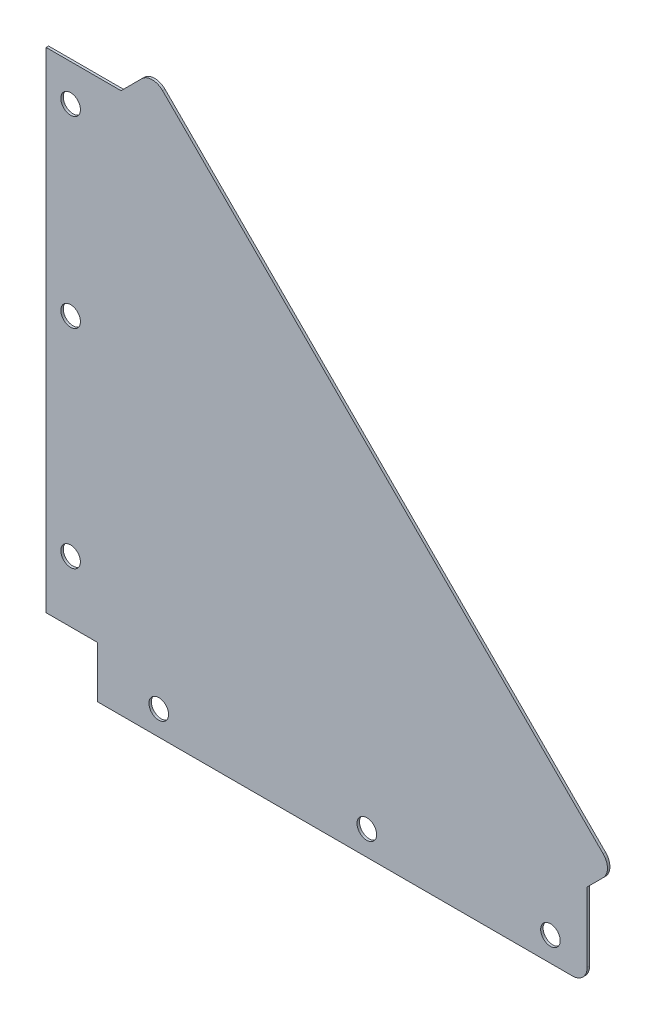
ISO-10303-21;
HEADER;
FILE_DESCRIPTION(('STEP AP214'),'2;1');
FILE_NAME('part.step','',(''),(''),'','','');
FILE_SCHEMA(('AUTOMOTIVE_DESIGN { 1 0 10303 214 1 1 1 1 }'));
ENDSEC;
DATA;
#1=APPLICATION_CONTEXT('core data for automotive mechanical design processes');
#2=APPLICATION_PROTOCOL_DEFINITION('international standard','automotive_design',2000,#1);
#3=PRODUCT_CONTEXT('',#1,'mechanical');
#4=PRODUCT('Part','Part','',(#3));
#5=PRODUCT_RELATED_PRODUCT_CATEGORY('part','',(#4));
#6=PRODUCT_DEFINITION_FORMATION('','',#4);
#7=PRODUCT_DEFINITION_CONTEXT('part definition',#1,'design');
#8=PRODUCT_DEFINITION('design','',#6,#7);
#9=PRODUCT_DEFINITION_SHAPE('','',#8);
#10=(LENGTH_UNIT() NAMED_UNIT(*) SI_UNIT(.MILLI.,.METRE.));
#11=(NAMED_UNIT(*) PLANE_ANGLE_UNIT() SI_UNIT($,.RADIAN.));
#12=(NAMED_UNIT(*) SI_UNIT($,.STERADIAN.) SOLID_ANGLE_UNIT());
#13=UNCERTAINTY_MEASURE_WITH_UNIT(LENGTH_MEASURE(1.E-05),#10,'distance_accuracy_value','');
#14=(GEOMETRIC_REPRESENTATION_CONTEXT(3) GLOBAL_UNCERTAINTY_ASSIGNED_CONTEXT((#13)) GLOBAL_UNIT_ASSIGNED_CONTEXT((#10,
#11,#12)) REPRESENTATION_CONTEXT('',''));
#15=CARTESIAN_POINT('',(0.,0.,0.));
#16=DIRECTION('',(0.,0.,1.));
#17=DIRECTION('',(1.,0.,0.));
#18=AXIS2_PLACEMENT_3D('',#15,#16,#17);
#19=CARTESIAN_POINT('',(215.,6.,1.));
#20=DIRECTION('',(0.,0.,1.));
#21=DIRECTION('',(1.,0.,0.));
#22=AXIS2_PLACEMENT_3D('',#19,#20,#21);
#23=PLANE('',#22);
#24=CARTESIAN_POINT('',(131.,10.,1.));
#25=DIRECTION('',(0.,0.,1.));
#26=DIRECTION('',(1.,0.,0.));
#27=AXIS2_PLACEMENT_3D('',#24,#25,#26);
#28=CIRCLE('',#27,3.99999999999999);
#29=CARTESIAN_POINT('',(135.,10.,1.));
#30=VERTEX_POINT('',#29);
#31=EDGE_CURVE('E299',#30,#30,#28,.T.);
#32=ORIENTED_EDGE('',*,*,#31,.F.);
#33=EDGE_LOOP('',(#32));
#34=FACE_BOUND('',#33,.T.);
#35=CARTESIAN_POINT('',(10.,131.,1.));
#36=DIRECTION('',(0.,0.,1.));
#37=DIRECTION('',(1.,0.,0.));
#38=AXIS2_PLACEMENT_3D('',#35,#36,#37);
#39=CIRCLE('',#38,4.);
#40=CARTESIAN_POINT('',(14.,131.,1.));
#41=VERTEX_POINT('',#40);
#42=EDGE_CURVE('E311',#41,#41,#39,.T.);
#43=ORIENTED_EDGE('',*,*,#42,.F.);
#44=EDGE_LOOP('',(#43));
#45=FACE_BOUND('',#44,.T.);
#46=CARTESIAN_POINT('',(10.,206.,1.));
#47=DIRECTION('',(0.,0.,1.));
#48=DIRECTION('',(1.,0.,0.));
#49=AXIS2_PLACEMENT_3D('',#46,#47,#48);
#50=CIRCLE('',#49,4.);
#51=CARTESIAN_POINT('',(14.,206.,1.));
#52=VERTEX_POINT('',#51);
#53=EDGE_CURVE('E158',#52,#52,#50,.T.);
#54=ORIENTED_EDGE('',*,*,#53,.F.);
#55=EDGE_LOOP('',(#54));
#56=FACE_BOUND('',#55,.T.);
#57=DIRECTION('',(0.,-1.,0.));
#58=VECTOR('',#57,1.);
#59=CARTESIAN_POINT('',(0.,221.,1.));
#60=LINE('',#59,#58);
#61=CARTESIAN_POINT('',(0.,221.,1.));
#62=VERTEX_POINT('',#61);
#63=CARTESIAN_POINT('',(0.,21.,1.));
#64=VERTEX_POINT('',#63);
#65=EDGE_CURVE('E177',#62,#64,#60,.T.);
#66=ORIENTED_EDGE('',*,*,#65,.T.);
#67=DIRECTION('',(1.,0.,0.));
#68=VECTOR('',#67,1.);
#69=CARTESIAN_POINT('',(0.,21.,1.));
#70=LINE('',#69,#68);
#71=CARTESIAN_POINT('',(21.,21.,1.));
#72=VERTEX_POINT('',#71);
#73=EDGE_CURVE('E105',#64,#72,#70,.T.);
#74=ORIENTED_EDGE('',*,*,#73,.T.);
#75=DIRECTION('',(0.,-1.,0.));
#76=VECTOR('',#75,1.);
#77=CARTESIAN_POINT('',(21.,21.,1.));
#78=LINE('',#77,#76);
#79=CARTESIAN_POINT('',(21.,0.,1.));
#80=VERTEX_POINT('',#79);
#81=EDGE_CURVE('E204',#72,#80,#78,.T.);
#82=ORIENTED_EDGE('',*,*,#81,.T.);
#83=DIRECTION('',(1.,0.,0.));
#84=VECTOR('',#83,1.);
#85=CARTESIAN_POINT('',(21.,0.,1.));
#86=LINE('',#85,#84);
#87=CARTESIAN_POINT('',(215.,0.,1.));
#88=VERTEX_POINT('',#87);
#89=EDGE_CURVE('E223',#80,#88,#86,.T.);
#90=ORIENTED_EDGE('',*,*,#89,.T.);
#91=CARTESIAN_POINT('',(215.,6.,1.));
#92=DIRECTION('',(0.,0.,1.));
#93=DIRECTION('',(1.,0.,0.));
#94=AXIS2_PLACEMENT_3D('',#91,#92,#93);
#95=CIRCLE('',#94,6.);
#96=CARTESIAN_POINT('',(221.,6.00000000000004,1.));
#97=VERTEX_POINT('',#96);
#98=EDGE_CURVE('E220',#88,#97,#95,.T.);
#99=ORIENTED_EDGE('',*,*,#98,.T.);
#100=DIRECTION('',(0.,1.,0.));
#101=VECTOR('',#100,1.);
#102=CARTESIAN_POINT('',(221.,6.00000000000004,1.));
#103=LINE('',#102,#101);
#104=CARTESIAN_POINT('',(221.,34.5,1.));
#105=VERTEX_POINT('',#104);
#106=EDGE_CURVE('E222',#97,#105,#103,.T.);
#107=ORIENTED_EDGE('',*,*,#106,.T.);
#108=DIRECTION('',(0.707106781186548,0.707106781186547,0.));
#109=VECTOR('',#108,1.);
#110=CARTESIAN_POINT('',(221.,34.5,1.));
#111=LINE('',#110,#109);
#112=CARTESIAN_POINT('',(227.535533905933,41.0355339059331,1.));
#113=VERTEX_POINT('',#112);
#114=EDGE_CURVE('E225',#105,#113,#111,.T.);
#115=ORIENTED_EDGE('',*,*,#114,.T.);
#116=CARTESIAN_POINT('',(223.292893218813,45.278174593052,1.));
#117=DIRECTION('',(0.,0.,1.));
#118=DIRECTION('',(1.,0.,0.));
#119=AXIS2_PLACEMENT_3D('',#116,#117,#118);
#120=CIRCLE('',#119,6.00000000000032);
#121=CARTESIAN_POINT('',(227.535533905933,49.5208152801715,1.));
#122=VERTEX_POINT('',#121);
#123=EDGE_CURVE('E231',#113,#122,#120,.T.);
#124=ORIENTED_EDGE('',*,*,#123,.T.);
#125=DIRECTION('',(-0.707106781186549,0.707106781186546,0.));
#126=VECTOR('',#125,1.);
#127=CARTESIAN_POINT('',(227.535533905933,49.5208152801717,1.));
#128=LINE('',#127,#126);
#129=CARTESIAN_POINT('',(47.5710678118651,229.485281374239,1.));
#130=VERTEX_POINT('',#129);
#131=EDGE_CURVE('E136',#122,#130,#128,.T.);
#132=ORIENTED_EDGE('',*,*,#131,.T.);
#133=CARTESIAN_POINT('',(43.3284271247454,225.242640687119,1.));
#134=DIRECTION('',(0.,0.,1.));
#135=DIRECTION('',(1.,0.,0.));
#136=AXIS2_PLACEMENT_3D('',#133,#134,#135);
#137=CIRCLE('',#136,6.00000000000027);
#138=CARTESIAN_POINT('',(39.0857864376263,229.485281374239,1.));
#139=VERTEX_POINT('',#138);
#140=EDGE_CURVE('E130',#130,#139,#137,.T.);
#141=ORIENTED_EDGE('',*,*,#140,.T.);
#142=DIRECTION('',(-0.707106781186545,-0.70710678118655,0.));
#143=VECTOR('',#142,1.);
#144=CARTESIAN_POINT('',(39.0857864376265,229.485281374239,1.));
#145=LINE('',#144,#143);
#146=CARTESIAN_POINT('',(30.6005050633876,221.,1.));
#147=VERTEX_POINT('',#146);
#148=EDGE_CURVE('E134',#139,#147,#145,.T.);
#149=ORIENTED_EDGE('',*,*,#148,.T.);
#150=DIRECTION('',(-1.,0.,0.));
#151=VECTOR('',#150,1.);
#152=CARTESIAN_POINT('',(30.6005050633876,221.,1.));
#153=LINE('',#152,#151);
#154=EDGE_CURVE('E50',#147,#62,#153,.T.);
#155=ORIENTED_EDGE('',*,*,#154,.T.);
#156=EDGE_LOOP('',(#66,#74,#82,#90,#99,#107,#115,#124,#132,#141,#149,#155));
#157=FACE_BOUND('',#156,.T.);
#158=CARTESIAN_POINT('',(10.,46.0000000000003,1.));
#159=DIRECTION('',(0.,0.,1.));
#160=DIRECTION('',(1.,0.,0.));
#161=AXIS2_PLACEMENT_3D('',#158,#159,#160);
#162=CIRCLE('',#161,4.);
#163=CARTESIAN_POINT('',(14.,46.0000000000003,1.));
#164=VERTEX_POINT('',#163);
#165=EDGE_CURVE('E317',#164,#164,#162,.T.);
#166=ORIENTED_EDGE('',*,*,#165,.F.);
#167=EDGE_LOOP('',(#166));
#168=FACE_BOUND('',#167,.T.);
#169=CARTESIAN_POINT('',(46.,10.,1.));
#170=DIRECTION('',(0.,0.,1.));
#171=DIRECTION('',(1.,0.,0.));
#172=AXIS2_PLACEMENT_3D('',#169,#170,#171);
#173=CIRCLE('',#172,4.00000000000001);
#174=CARTESIAN_POINT('',(50.,10.,1.));
#175=VERTEX_POINT('',#174);
#176=EDGE_CURVE('E305',#175,#175,#173,.T.);
#177=ORIENTED_EDGE('',*,*,#176,.F.);
#178=EDGE_LOOP('',(#177));
#179=FACE_BOUND('',#178,.T.);
#180=CARTESIAN_POINT('',(206.,10.,1.));
#181=DIRECTION('',(0.,0.,1.));
#182=DIRECTION('',(1.,0.,0.));
#183=AXIS2_PLACEMENT_3D('',#180,#181,#182);
#184=CIRCLE('',#183,3.99999999999999);
#185=CARTESIAN_POINT('',(210.,10.,1.));
#186=VERTEX_POINT('',#185);
#187=EDGE_CURVE('E290',#186,#186,#184,.T.);
#188=ORIENTED_EDGE('',*,*,#187,.F.);
#189=EDGE_LOOP('',(#188));
#190=FACE_BOUND('',#189,.T.);
#191=ADVANCED_FACE('F33',(#34,#45,#56,#157,#168,#179,#190),#23,.T.);
#192=CARTESIAN_POINT('',(215.,6.,0.));
#193=DIRECTION('',(0.,0.,1.));
#194=DIRECTION('',(1.,0.,0.));
#195=AXIS2_PLACEMENT_3D('',#192,#193,#194);
#196=PLANE('',#195);
#197=DIRECTION('',(0.,-1.,0.));
#198=VECTOR('',#197,1.);
#199=CARTESIAN_POINT('',(0.,221.,0.));
#200=LINE('',#199,#198);
#201=CARTESIAN_POINT('',(0.,221.,0.));
#202=VERTEX_POINT('',#201);
#203=CARTESIAN_POINT('',(0.,21.,0.));
#204=VERTEX_POINT('',#203);
#205=EDGE_CURVE('E154',#202,#204,#200,.T.);
#206=ORIENTED_EDGE('',*,*,#205,.F.);
#207=DIRECTION('',(-1.,0.,0.));
#208=VECTOR('',#207,1.);
#209=CARTESIAN_POINT('',(30.6005050633876,221.,0.));
#210=LINE('',#209,#208);
#211=CARTESIAN_POINT('',(30.6005050633876,221.,0.));
#212=VERTEX_POINT('',#211);
#213=EDGE_CURVE('E97',#212,#202,#210,.T.);
#214=ORIENTED_EDGE('',*,*,#213,.F.);
#215=DIRECTION('',(-0.707106781186545,-0.70710678118655,0.));
#216=VECTOR('',#215,1.);
#217=CARTESIAN_POINT('',(39.0857864376265,229.485281374239,0.));
#218=LINE('',#217,#216);
#219=CARTESIAN_POINT('',(39.0857864376263,229.485281374239,0.));
#220=VERTEX_POINT('',#219);
#221=EDGE_CURVE('E91',#220,#212,#218,.T.);
#222=ORIENTED_EDGE('',*,*,#221,.F.);
#223=CARTESIAN_POINT('',(43.3284271247454,225.242640687119,0.));
#224=DIRECTION('',(0.,0.,1.));
#225=DIRECTION('',(1.,0.,0.));
#226=AXIS2_PLACEMENT_3D('',#223,#224,#225);
#227=CIRCLE('',#226,6.00000000000027);
#228=CARTESIAN_POINT('',(47.5710678118651,229.485281374239,0.));
#229=VERTEX_POINT('',#228);
#230=EDGE_CURVE('E144',#229,#220,#227,.T.);
#231=ORIENTED_EDGE('',*,*,#230,.F.);
#232=DIRECTION('',(-0.707106781186549,0.707106781186546,0.));
#233=VECTOR('',#232,1.);
#234=CARTESIAN_POINT('',(227.535533905933,49.5208152801717,0.));
#235=LINE('',#234,#233);
#236=CARTESIAN_POINT('',(227.535533905933,49.5208152801715,0.));
#237=VERTEX_POINT('',#236);
#238=EDGE_CURVE('E172',#237,#229,#235,.T.);
#239=ORIENTED_EDGE('',*,*,#238,.F.);
#240=CARTESIAN_POINT('',(223.292893218813,45.278174593052,0.));
#241=DIRECTION('',(0.,0.,1.));
#242=DIRECTION('',(1.,0.,0.));
#243=AXIS2_PLACEMENT_3D('',#240,#241,#242);
#244=CIRCLE('',#243,6.00000000000032);
#245=CARTESIAN_POINT('',(227.535533905933,41.0355339059331,0.));
#246=VERTEX_POINT('',#245);
#247=EDGE_CURVE('E170',#246,#237,#244,.T.);
#248=ORIENTED_EDGE('',*,*,#247,.F.);
#249=DIRECTION('',(0.707106781186548,0.707106781186547,0.));
#250=VECTOR('',#249,1.);
#251=CARTESIAN_POINT('',(221.,34.5,0.));
#252=LINE('',#251,#250);
#253=CARTESIAN_POINT('',(221.,34.5,0.));
#254=VERTEX_POINT('',#253);
#255=EDGE_CURVE('E168',#254,#246,#252,.T.);
#256=ORIENTED_EDGE('',*,*,#255,.F.);
#257=DIRECTION('',(0.,1.,0.));
#258=VECTOR('',#257,1.);
#259=CARTESIAN_POINT('',(221.,6.00000000000004,0.));
#260=LINE('',#259,#258);
#261=CARTESIAN_POINT('',(221.,6.00000000000004,0.));
#262=VERTEX_POINT('',#261);
#263=EDGE_CURVE('E166',#262,#254,#260,.T.);
#264=ORIENTED_EDGE('',*,*,#263,.F.);
#265=CARTESIAN_POINT('',(215.,6.,0.));
#266=DIRECTION('',(0.,0.,1.));
#267=DIRECTION('',(1.,0.,0.));
#268=AXIS2_PLACEMENT_3D('',#265,#266,#267);
#269=CIRCLE('',#268,6.);
#270=CARTESIAN_POINT('',(215.,0.,0.));
#271=VERTEX_POINT('',#270);
#272=EDGE_CURVE('E164',#271,#262,#269,.T.);
#273=ORIENTED_EDGE('',*,*,#272,.F.);
#274=DIRECTION('',(1.,0.,0.));
#275=VECTOR('',#274,1.);
#276=CARTESIAN_POINT('',(21.,0.,0.));
#277=LINE('',#276,#275);
#278=CARTESIAN_POINT('',(21.,0.,0.));
#279=VERTEX_POINT('',#278);
#280=EDGE_CURVE('E162',#279,#271,#277,.T.);
#281=ORIENTED_EDGE('',*,*,#280,.F.);
#282=DIRECTION('',(0.,-1.,0.));
#283=VECTOR('',#282,1.);
#284=CARTESIAN_POINT('',(21.,21.,0.));
#285=LINE('',#284,#283);
#286=CARTESIAN_POINT('',(21.,21.,0.));
#287=VERTEX_POINT('',#286);
#288=EDGE_CURVE('E160',#287,#279,#285,.T.);
#289=ORIENTED_EDGE('',*,*,#288,.F.);
#290=DIRECTION('',(1.,0.,0.));
#291=VECTOR('',#290,1.);
#292=CARTESIAN_POINT('',(0.,21.,0.));
#293=LINE('',#292,#291);
#294=EDGE_CURVE('E157',#204,#287,#293,.T.);
#295=ORIENTED_EDGE('',*,*,#294,.F.);
#296=EDGE_LOOP('',(#206,#214,#222,#231,#239,#248,#256,#264,#273,#281,#289,#295));
#297=FACE_BOUND('',#296,.T.);
#298=CARTESIAN_POINT('',(10.,206.,0.));
#299=DIRECTION('',(0.,0.,1.));
#300=DIRECTION('',(1.,0.,0.));
#301=AXIS2_PLACEMENT_3D('',#298,#299,#300);
#302=CIRCLE('',#301,4.);
#303=CARTESIAN_POINT('',(14.,206.,0.));
#304=VERTEX_POINT('',#303);
#305=EDGE_CURVE('E320',#304,#304,#302,.T.);
#306=ORIENTED_EDGE('',*,*,#305,.T.);
#307=EDGE_LOOP('',(#306));
#308=FACE_BOUND('',#307,.T.);
#309=CARTESIAN_POINT('',(10.,46.0000000000003,0.));
#310=DIRECTION('',(0.,0.,1.));
#311=DIRECTION('',(1.,0.,0.));
#312=AXIS2_PLACEMENT_3D('',#309,#310,#311);
#313=CIRCLE('',#312,4.);
#314=CARTESIAN_POINT('',(14.,46.0000000000003,0.));
#315=VERTEX_POINT('',#314);
#316=EDGE_CURVE('E314',#315,#315,#313,.T.);
#317=ORIENTED_EDGE('',*,*,#316,.T.);
#318=EDGE_LOOP('',(#317));
#319=FACE_BOUND('',#318,.T.);
#320=CARTESIAN_POINT('',(10.,131.,0.));
#321=DIRECTION('',(0.,0.,1.));
#322=DIRECTION('',(1.,0.,0.));
#323=AXIS2_PLACEMENT_3D('',#320,#321,#322);
#324=CIRCLE('',#323,4.);
#325=CARTESIAN_POINT('',(14.,131.,0.));
#326=VERTEX_POINT('',#325);
#327=EDGE_CURVE('E308',#326,#326,#324,.T.);
#328=ORIENTED_EDGE('',*,*,#327,.T.);
#329=EDGE_LOOP('',(#328));
#330=FACE_BOUND('',#329,.T.);
#331=CARTESIAN_POINT('',(46.,10.,0.));
#332=DIRECTION('',(0.,0.,1.));
#333=DIRECTION('',(1.,0.,0.));
#334=AXIS2_PLACEMENT_3D('',#331,#332,#333);
#335=CIRCLE('',#334,4.00000000000001);
#336=CARTESIAN_POINT('',(50.,10.,0.));
#337=VERTEX_POINT('',#336);
#338=EDGE_CURVE('E302',#337,#337,#335,.T.);
#339=ORIENTED_EDGE('',*,*,#338,.T.);
#340=EDGE_LOOP('',(#339));
#341=FACE_BOUND('',#340,.T.);
#342=CARTESIAN_POINT('',(131.,10.,0.));
#343=DIRECTION('',(0.,0.,1.));
#344=DIRECTION('',(1.,0.,0.));
#345=AXIS2_PLACEMENT_3D('',#342,#343,#344);
#346=CIRCLE('',#345,3.99999999999999);
#347=CARTESIAN_POINT('',(135.,10.,0.));
#348=VERTEX_POINT('',#347);
#349=EDGE_CURVE('E296',#348,#348,#346,.T.);
#350=ORIENTED_EDGE('',*,*,#349,.T.);
#351=EDGE_LOOP('',(#350));
#352=FACE_BOUND('',#351,.T.);
#353=CARTESIAN_POINT('',(206.,10.,0.));
#354=DIRECTION('',(0.,0.,1.));
#355=DIRECTION('',(1.,0.,0.));
#356=AXIS2_PLACEMENT_3D('',#353,#354,#355);
#357=CIRCLE('',#356,3.99999999999999);
#358=CARTESIAN_POINT('',(210.,10.,0.));
#359=VERTEX_POINT('',#358);
#360=EDGE_CURVE('E293',#359,#359,#357,.T.);
#361=ORIENTED_EDGE('',*,*,#360,.T.);
#362=EDGE_LOOP('',(#361));
#363=FACE_BOUND('',#362,.T.);
#364=ADVANCED_FACE('F208',(#297,#308,#319,#330,#341,#352,#363),#196,.F.);
#365=CARTESIAN_POINT('',(0.,221.,1.));
#366=DIRECTION('',(1.,0.,0.));
#367=DIRECTION('',(0.,1.,0.));
#368=AXIS2_PLACEMENT_3D('',#365,#366,#367);
#369=PLANE('',#368);
#370=ORIENTED_EDGE('',*,*,#205,.T.);
#371=DIRECTION('',(0.,0.,-1.));
#372=VECTOR('',#371,1.);
#373=CARTESIAN_POINT('',(0.,21.,1.));
#374=LINE('',#373,#372);
#375=EDGE_CURVE('E11',#64,#204,#374,.T.);
#376=ORIENTED_EDGE('',*,*,#375,.F.);
#377=ORIENTED_EDGE('',*,*,#65,.F.);
#378=DIRECTION('',(0.,0.,-1.));
#379=VECTOR('',#378,1.);
#380=CARTESIAN_POINT('',(0.,221.,1.));
#381=LINE('',#380,#379);
#382=EDGE_CURVE('E150',#62,#202,#381,.T.);
#383=ORIENTED_EDGE('',*,*,#382,.T.);
#384=EDGE_LOOP('',(#370,#376,#377,#383));
#385=FACE_BOUND('',#384,.T.);
#386=ADVANCED_FACE('F35',(#385),#369,.F.);
#387=CARTESIAN_POINT('',(0.,21.,1.));
#388=DIRECTION('',(0.,1.,0.));
#389=DIRECTION('',(0.,0.,1.));
#390=AXIS2_PLACEMENT_3D('',#387,#388,#389);
#391=PLANE('',#390);
#392=ORIENTED_EDGE('',*,*,#294,.T.);
#393=DIRECTION('',(0.,0.,-1.));
#394=VECTOR('',#393,1.);
#395=CARTESIAN_POINT('',(21.,21.,1.));
#396=LINE('',#395,#394);
#397=EDGE_CURVE('E42',#72,#287,#396,.T.);
#398=ORIENTED_EDGE('',*,*,#397,.F.);
#399=ORIENTED_EDGE('',*,*,#73,.F.);
#400=ORIENTED_EDGE('',*,*,#375,.T.);
#401=EDGE_LOOP('',(#392,#398,#399,#400));
#402=FACE_BOUND('',#401,.T.);
#403=ADVANCED_FACE('F448',(#402),#391,.F.);
#404=CARTESIAN_POINT('',(21.,21.,1.));
#405=DIRECTION('',(1.,0.,0.));
#406=DIRECTION('',(0.,1.,0.));
#407=AXIS2_PLACEMENT_3D('',#404,#405,#406);
#408=PLANE('',#407);
#409=ORIENTED_EDGE('',*,*,#288,.T.);
#410=DIRECTION('',(0.,0.,-1.));
#411=VECTOR('',#410,1.);
#412=CARTESIAN_POINT('',(21.,0.,1.));
#413=LINE('',#412,#411);
#414=EDGE_CURVE('E196',#80,#279,#413,.T.);
#415=ORIENTED_EDGE('',*,*,#414,.F.);
#416=ORIENTED_EDGE('',*,*,#81,.F.);
#417=ORIENTED_EDGE('',*,*,#397,.T.);
#418=EDGE_LOOP('',(#409,#415,#416,#417));
#419=FACE_BOUND('',#418,.T.);
#420=ADVANCED_FACE('F202',(#419),#408,.F.);
#421=CARTESIAN_POINT('',(21.,0.,1.));
#422=DIRECTION('',(0.,1.,0.));
#423=DIRECTION('',(0.,0.,1.));
#424=AXIS2_PLACEMENT_3D('',#421,#422,#423);
#425=PLANE('',#424);
#426=ORIENTED_EDGE('',*,*,#280,.T.);
#427=DIRECTION('',(0.,0.,-1.));
#428=VECTOR('',#427,1.);
#429=CARTESIAN_POINT('',(215.,0.,1.));
#430=LINE('',#429,#428);
#431=EDGE_CURVE('E193',#88,#271,#430,.T.);
#432=ORIENTED_EDGE('',*,*,#431,.F.);
#433=ORIENTED_EDGE('',*,*,#89,.F.);
#434=ORIENTED_EDGE('',*,*,#414,.T.);
#435=EDGE_LOOP('',(#426,#432,#433,#434));
#436=FACE_BOUND('',#435,.T.);
#437=ADVANCED_FACE('F214',(#436),#425,.F.);
#438=CARTESIAN_POINT('',(215.,6.,1.));
#439=DIRECTION('',(0.,0.,-1.));
#440=DIRECTION('',(-1.,0.,0.));
#441=AXIS2_PLACEMENT_3D('',#438,#439,#440);
#442=CYLINDRICAL_SURFACE('',#441,6.);
#443=ORIENTED_EDGE('',*,*,#272,.T.);
#444=DIRECTION('',(0.,0.,-1.));
#445=VECTOR('',#444,1.);
#446=CARTESIAN_POINT('',(221.,6.00000000000004,1.));
#447=LINE('',#446,#445);
#448=EDGE_CURVE('E190',#97,#262,#447,.T.);
#449=ORIENTED_EDGE('',*,*,#448,.F.);
#450=ORIENTED_EDGE('',*,*,#98,.F.);
#451=ORIENTED_EDGE('',*,*,#431,.T.);
#452=EDGE_LOOP('',(#443,#449,#450,#451));
#453=FACE_BOUND('',#452,.T.);
#454=ADVANCED_FACE('F218',(#453),#442,.T.);
#455=CARTESIAN_POINT('',(221.,6.00000000000004,1.));
#456=DIRECTION('',(-1.,0.,0.));
#457=DIRECTION('',(0.,0.,1.));
#458=AXIS2_PLACEMENT_3D('',#455,#456,#457);
#459=PLANE('',#458);
#460=ORIENTED_EDGE('',*,*,#263,.T.);
#461=DIRECTION('',(0.,0.,-1.));
#462=VECTOR('',#461,1.);
#463=CARTESIAN_POINT('',(221.,34.5,1.));
#464=LINE('',#463,#462);
#465=EDGE_CURVE('E187',#105,#254,#464,.T.);
#466=ORIENTED_EDGE('',*,*,#465,.F.);
#467=ORIENTED_EDGE('',*,*,#106,.F.);
#468=ORIENTED_EDGE('',*,*,#448,.T.);
#469=EDGE_LOOP('',(#460,#466,#467,#468));
#470=FACE_BOUND('',#469,.T.);
#471=ADVANCED_FACE('F413',(#470),#459,.F.);
#472=CARTESIAN_POINT('',(221.,34.5,1.));
#473=DIRECTION('',(-0.707106781186547,0.707106781186548,0.));
#474=DIRECTION('',(-0.707106781186548,-0.707106781186547,0.));
#475=AXIS2_PLACEMENT_3D('',#472,#473,#474);
#476=PLANE('',#475);
#477=ORIENTED_EDGE('',*,*,#255,.T.);
#478=DIRECTION('',(0.,0.,-1.));
#479=VECTOR('',#478,1.);
#480=CARTESIAN_POINT('',(227.535533905933,41.0355339059331,1.));
#481=LINE('',#480,#479);
#482=EDGE_CURVE('E184',#113,#246,#481,.T.);
#483=ORIENTED_EDGE('',*,*,#482,.F.);
#484=ORIENTED_EDGE('',*,*,#114,.F.);
#485=ORIENTED_EDGE('',*,*,#465,.T.);
#486=EDGE_LOOP('',(#477,#483,#484,#485));
#487=FACE_BOUND('',#486,.T.);
#488=ADVANCED_FACE('F404',(#487),#476,.F.);
#489=CARTESIAN_POINT('',(223.292893218813,45.278174593052,1.));
#490=DIRECTION('',(0.,0.,-1.));
#491=DIRECTION('',(-1.,0.,0.));
#492=AXIS2_PLACEMENT_3D('',#489,#490,#491);
#493=CYLINDRICAL_SURFACE('',#492,6.00000000000032);
#494=ORIENTED_EDGE('',*,*,#247,.T.);
#495=DIRECTION('',(0.,0.,-1.));
#496=VECTOR('',#495,1.);
#497=CARTESIAN_POINT('',(227.535533905933,49.5208152801715,1.));
#498=LINE('',#497,#496);
#499=EDGE_CURVE('E181',#122,#237,#498,.T.);
#500=ORIENTED_EDGE('',*,*,#499,.F.);
#501=ORIENTED_EDGE('',*,*,#123,.F.);
#502=ORIENTED_EDGE('',*,*,#482,.T.);
#503=EDGE_LOOP('',(#494,#500,#501,#502));
#504=FACE_BOUND('',#503,.T.);
#505=ADVANCED_FACE('F237',(#504),#493,.T.);
#506=CARTESIAN_POINT('',(227.535533905933,49.5208152801717,1.));
#507=DIRECTION('',(-0.707106781186546,-0.707106781186549,0.));
#508=DIRECTION('',(0.707106781186549,-0.707106781186546,0.));
#509=AXIS2_PLACEMENT_3D('',#506,#507,#508);
#510=PLANE('',#509);
#511=ORIENTED_EDGE('',*,*,#238,.T.);
#512=DIRECTION('',(0.,0.,-1.));
#513=VECTOR('',#512,1.);
#514=CARTESIAN_POINT('',(47.5710678118651,229.485281374239,1.));
#515=LINE('',#514,#513);
#516=EDGE_CURVE('E145',#130,#229,#515,.T.);
#517=ORIENTED_EDGE('',*,*,#516,.F.);
#518=ORIENTED_EDGE('',*,*,#131,.F.);
#519=ORIENTED_EDGE('',*,*,#499,.T.);
#520=EDGE_LOOP('',(#511,#517,#518,#519));
#521=FACE_BOUND('',#520,.T.);
#522=ADVANCED_FACE('F241',(#521),#510,.F.);
#523=CARTESIAN_POINT('',(43.3284271247454,225.242640687119,1.));
#524=DIRECTION('',(0.,0.,-1.));
#525=DIRECTION('',(-1.,0.,0.));
#526=AXIS2_PLACEMENT_3D('',#523,#524,#525);
#527=CYLINDRICAL_SURFACE('',#526,6.00000000000027);
#528=ORIENTED_EDGE('',*,*,#230,.T.);
#529=DIRECTION('',(0.,0.,-1.));
#530=VECTOR('',#529,1.);
#531=CARTESIAN_POINT('',(39.0857864376263,229.485281374239,1.));
#532=LINE('',#531,#530);
#533=EDGE_CURVE('E141',#139,#220,#532,.T.);
#534=ORIENTED_EDGE('',*,*,#533,.F.);
#535=ORIENTED_EDGE('',*,*,#140,.F.);
#536=ORIENTED_EDGE('',*,*,#516,.T.);
#537=EDGE_LOOP('',(#528,#534,#535,#536));
#538=FACE_BOUND('',#537,.T.);
#539=ADVANCED_FACE('F142',(#538),#527,.T.);
#540=CARTESIAN_POINT('',(39.0857864376265,229.485281374239,1.));
#541=DIRECTION('',(0.70710678118655,-0.707106781186545,0.));
#542=DIRECTION('',(0.707106781186545,0.70710678118655,0.));
#543=AXIS2_PLACEMENT_3D('',#540,#541,#542);
#544=PLANE('',#543);
#545=ORIENTED_EDGE('',*,*,#221,.T.);
#546=DIRECTION('',(0.,0.,-1.));
#547=VECTOR('',#546,1.);
#548=CARTESIAN_POINT('',(30.6005050633876,221.,1.));
#549=LINE('',#548,#547);
#550=EDGE_CURVE('E146',#147,#212,#549,.T.);
#551=ORIENTED_EDGE('',*,*,#550,.F.);
#552=ORIENTED_EDGE('',*,*,#148,.F.);
#553=ORIENTED_EDGE('',*,*,#533,.T.);
#554=EDGE_LOOP('',(#545,#551,#552,#553));
#555=FACE_BOUND('',#554,.T.);
#556=ADVANCED_FACE('F148',(#555),#544,.F.);
#557=CARTESIAN_POINT('',(30.6005050633876,221.,1.));
#558=DIRECTION('',(0.,-1.,0.));
#559=DIRECTION('',(0.,0.,-1.));
#560=AXIS2_PLACEMENT_3D('',#557,#558,#559);
#561=PLANE('',#560);
#562=ORIENTED_EDGE('',*,*,#213,.T.);
#563=ORIENTED_EDGE('',*,*,#382,.F.);
#564=ORIENTED_EDGE('',*,*,#154,.F.);
#565=ORIENTED_EDGE('',*,*,#550,.T.);
#566=EDGE_LOOP('',(#562,#563,#564,#565));
#567=FACE_BOUND('',#566,.T.);
#568=ADVANCED_FACE('F245',(#567),#561,.F.);
#569=CARTESIAN_POINT('',(10.,206.,1.));
#570=DIRECTION('',(0.,0.,-1.));
#571=DIRECTION('',(-1.,0.,0.));
#572=AXIS2_PLACEMENT_3D('',#569,#570,#571);
#573=CYLINDRICAL_SURFACE('',#572,4.);
#574=ORIENTED_EDGE('',*,*,#53,.T.);
#575=EDGE_LOOP('',(#574));
#576=FACE_BOUND('',#575,.T.);
#577=ORIENTED_EDGE('',*,*,#305,.F.);
#578=EDGE_LOOP('',(#577));
#579=FACE_BOUND('',#578,.T.);
#580=ADVANCED_FACE('F247',(#576,#579),#573,.F.);
#581=CARTESIAN_POINT('',(10.,46.0000000000003,1.));
#582=DIRECTION('',(0.,0.,-1.));
#583=DIRECTION('',(-1.,0.,0.));
#584=AXIS2_PLACEMENT_3D('',#581,#582,#583);
#585=CYLINDRICAL_SURFACE('',#584,4.);
#586=ORIENTED_EDGE('',*,*,#165,.T.);
#587=EDGE_LOOP('',(#586));
#588=FACE_BOUND('',#587,.T.);
#589=ORIENTED_EDGE('',*,*,#316,.F.);
#590=EDGE_LOOP('',(#589));
#591=FACE_BOUND('',#590,.T.);
#592=ADVANCED_FACE('F253',(#588,#591),#585,.F.);
#593=CARTESIAN_POINT('',(10.,131.,1.));
#594=DIRECTION('',(0.,0.,-1.));
#595=DIRECTION('',(-1.,0.,0.));
#596=AXIS2_PLACEMENT_3D('',#593,#594,#595);
#597=CYLINDRICAL_SURFACE('',#596,4.);
#598=ORIENTED_EDGE('',*,*,#42,.T.);
#599=EDGE_LOOP('',(#598));
#600=FACE_BOUND('',#599,.T.);
#601=ORIENTED_EDGE('',*,*,#327,.F.);
#602=EDGE_LOOP('',(#601));
#603=FACE_BOUND('',#602,.T.);
#604=ADVANCED_FACE('F269',(#600,#603),#597,.F.);
#605=CARTESIAN_POINT('',(46.,10.,1.));
#606=DIRECTION('',(0.,0.,-1.));
#607=DIRECTION('',(-1.,0.,0.));
#608=AXIS2_PLACEMENT_3D('',#605,#606,#607);
#609=CYLINDRICAL_SURFACE('',#608,4.00000000000001);
#610=ORIENTED_EDGE('',*,*,#176,.T.);
#611=EDGE_LOOP('',(#610));
#612=FACE_BOUND('',#611,.T.);
#613=ORIENTED_EDGE('',*,*,#338,.F.);
#614=EDGE_LOOP('',(#613));
#615=FACE_BOUND('',#614,.T.);
#616=ADVANCED_FACE('F273',(#612,#615),#609,.F.);
#617=CARTESIAN_POINT('',(131.,10.,1.));
#618=DIRECTION('',(0.,0.,-1.));
#619=DIRECTION('',(-1.,0.,0.));
#620=AXIS2_PLACEMENT_3D('',#617,#618,#619);
#621=CYLINDRICAL_SURFACE('',#620,3.99999999999999);
#622=ORIENTED_EDGE('',*,*,#31,.T.);
#623=EDGE_LOOP('',(#622));
#624=FACE_BOUND('',#623,.T.);
#625=ORIENTED_EDGE('',*,*,#349,.F.);
#626=EDGE_LOOP('',(#625));
#627=FACE_BOUND('',#626,.T.);
#628=ADVANCED_FACE('F277',(#624,#627),#621,.F.);
#629=CARTESIAN_POINT('',(206.,10.,1.));
#630=DIRECTION('',(0.,0.,-1.));
#631=DIRECTION('',(-1.,0.,0.));
#632=AXIS2_PLACEMENT_3D('',#629,#630,#631);
#633=CYLINDRICAL_SURFACE('',#632,3.99999999999999);
#634=ORIENTED_EDGE('',*,*,#187,.T.);
#635=EDGE_LOOP('',(#634));
#636=FACE_BOUND('',#635,.T.);
#637=ORIENTED_EDGE('',*,*,#360,.F.);
#638=EDGE_LOOP('',(#637));
#639=FACE_BOUND('',#638,.T.);
#640=ADVANCED_FACE('F281',(#636,#639),#633,.F.);
#641=CLOSED_SHELL('',(#191,#364,#386,#403,#420,#437,#454,#471,#488,#505,#522,#539,#556,#568,
#580,#592,#604,#616,#628,#640));
#642=MANIFOLD_SOLID_BREP('B2',#641);
#643=ADVANCED_BREP_SHAPE_REPRESENTATION('',(#18,#642),#14);
#644=SHAPE_DEFINITION_REPRESENTATION(#9,#643);
ENDSEC;
END-ISO-10303-21;
